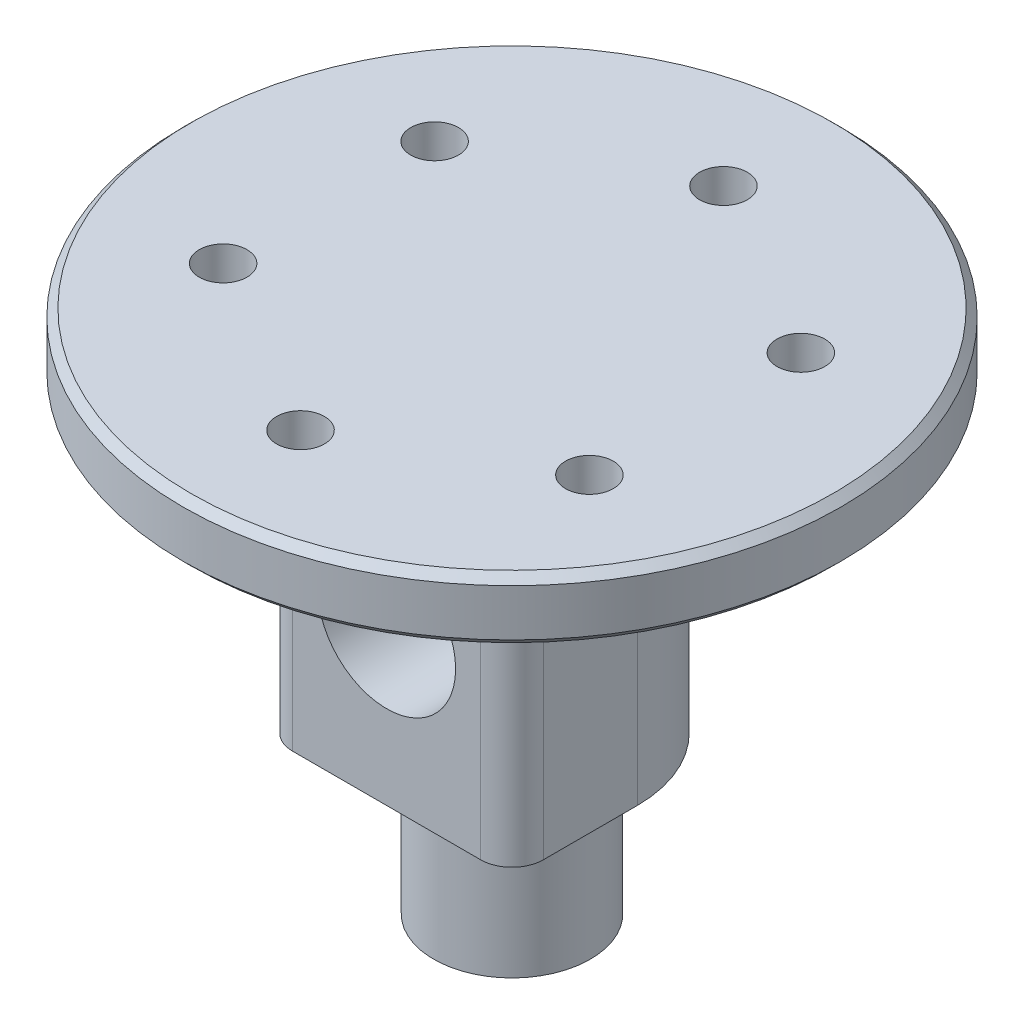
ISO-10303-21;
HEADER;
FILE_DESCRIPTION(('STEP AP214'),'2;1');
FILE_NAME('part.step','',(''),(''),'','','');
FILE_SCHEMA(('AUTOMOTIVE_DESIGN { 1 0 10303 214 1 1 1 1 }'));
ENDSEC;
DATA;
#1=APPLICATION_CONTEXT('core data for automotive mechanical design processes');
#2=APPLICATION_PROTOCOL_DEFINITION('international standard','automotive_design',2000,#1);
#3=PRODUCT_CONTEXT('',#1,'mechanical');
#4=PRODUCT('Part','Part','',(#3));
#5=PRODUCT_RELATED_PRODUCT_CATEGORY('part','',(#4));
#6=PRODUCT_DEFINITION_FORMATION('','',#4);
#7=PRODUCT_DEFINITION_CONTEXT('part definition',#1,'design');
#8=PRODUCT_DEFINITION('design','',#6,#7);
#9=PRODUCT_DEFINITION_SHAPE('','',#8);
#10=(LENGTH_UNIT() NAMED_UNIT(*) SI_UNIT(.MILLI.,.METRE.));
#11=(NAMED_UNIT(*) PLANE_ANGLE_UNIT() SI_UNIT($,.RADIAN.));
#12=(NAMED_UNIT(*) SI_UNIT($,.STERADIAN.) SOLID_ANGLE_UNIT());
#13=UNCERTAINTY_MEASURE_WITH_UNIT(LENGTH_MEASURE(1.E-05),#10,'distance_accuracy_value','');
#14=(GEOMETRIC_REPRESENTATION_CONTEXT(3) GLOBAL_UNCERTAINTY_ASSIGNED_CONTEXT((#13)) GLOBAL_UNIT_ASSIGNED_CONTEXT((#10,
#11,#12)) REPRESENTATION_CONTEXT('',''));
#15=CARTESIAN_POINT('',(0.,0.,0.));
#16=DIRECTION('',(0.,0.,1.));
#17=DIRECTION('',(1.,0.,0.));
#18=AXIS2_PLACEMENT_3D('',#15,#16,#17);
#19=CARTESIAN_POINT('',(0.,19.5,0.));
#20=DIRECTION('',(0.,1.,0.));
#21=DIRECTION('',(0.,0.,1.));
#22=AXIS2_PLACEMENT_3D('',#19,#20,#21);
#23=PLANE('',#22);
#24=CARTESIAN_POINT('',(0.,19.5,0.));
#25=DIRECTION('',(0.,1.,0.));
#26=DIRECTION('',(0.,0.,1.));
#27=AXIS2_PLACEMENT_3D('',#24,#25,#26);
#28=CIRCLE('',#27,20.5);
#29=CARTESIAN_POINT('',(0.,19.5,20.5));
#30=VERTEX_POINT('',#29);
#31=EDGE_CURVE('E11',#30,#30,#28,.F.);
#32=ORIENTED_EDGE('',*,*,#31,.T.);
#33=EDGE_LOOP('',(#32));
#34=FACE_BOUND('',#33,.T.);
#35=CARTESIAN_POINT('',(0.,19.5,-13.5));
#36=DIRECTION('',(0.,-1.,0.));
#37=DIRECTION('',(0.,0.,-1.));
#38=AXIS2_PLACEMENT_3D('',#35,#36,#37);
#39=CIRCLE('',#38,1.525);
#40=CARTESIAN_POINT('',(0.,19.5,-15.025));
#41=VERTEX_POINT('',#40);
#42=EDGE_CURVE('E162',#41,#41,#39,.T.);
#43=ORIENTED_EDGE('',*,*,#42,.F.);
#44=EDGE_LOOP('',(#43));
#45=FACE_BOUND('',#44,.T.);
#46=CARTESIAN_POINT('',(11.6913429510898,19.5,-6.75000000000014));
#47=DIRECTION('',(0.,-1.,0.));
#48=DIRECTION('',(0.,0.,-1.));
#49=AXIS2_PLACEMENT_3D('',#46,#47,#48);
#50=CIRCLE('',#49,1.525);
#51=CARTESIAN_POINT('',(11.6913429510898,19.5,-8.27500000000014));
#52=VERTEX_POINT('',#51);
#53=EDGE_CURVE('E156',#52,#52,#50,.T.);
#54=ORIENTED_EDGE('',*,*,#53,.F.);
#55=EDGE_LOOP('',(#54));
#56=FACE_BOUND('',#55,.T.);
#57=CARTESIAN_POINT('',(11.69134295109,19.5,6.74999999999989));
#58=DIRECTION('',(0.,-1.,0.));
#59=DIRECTION('',(0.,0.,-1.));
#60=AXIS2_PLACEMENT_3D('',#57,#58,#59);
#61=CIRCLE('',#60,1.525);
#62=CARTESIAN_POINT('',(11.69134295109,19.5,5.22499999999989));
#63=VERTEX_POINT('',#62);
#64=EDGE_CURVE('E171',#63,#63,#61,.T.);
#65=ORIENTED_EDGE('',*,*,#64,.F.);
#66=EDGE_LOOP('',(#65));
#67=FACE_BOUND('',#66,.T.);
#68=CARTESIAN_POINT('',(0.,19.5,13.5));
#69=DIRECTION('',(0.,-1.,0.));
#70=DIRECTION('',(0.,0.,-1.));
#71=AXIS2_PLACEMENT_3D('',#68,#69,#70);
#72=CIRCLE('',#71,1.525);
#73=CARTESIAN_POINT('',(0.,19.5,11.975));
#74=VERTEX_POINT('',#73);
#75=EDGE_CURVE('E194',#74,#74,#72,.T.);
#76=ORIENTED_EDGE('',*,*,#75,.F.);
#77=EDGE_LOOP('',(#76));
#78=FACE_BOUND('',#77,.T.);
#79=CARTESIAN_POINT('',(-11.6913429510899,19.5,6.75000000000005));
#80=DIRECTION('',(0.,-1.,0.));
#81=DIRECTION('',(0.,0.,-1.));
#82=AXIS2_PLACEMENT_3D('',#79,#80,#81);
#83=CIRCLE('',#82,1.525);
#84=CARTESIAN_POINT('',(-11.6913429510899,19.5,5.22500000000005));
#85=VERTEX_POINT('',#84);
#86=EDGE_CURVE('E186',#85,#85,#83,.T.);
#87=ORIENTED_EDGE('',*,*,#86,.F.);
#88=EDGE_LOOP('',(#87));
#89=FACE_BOUND('',#88,.T.);
#90=CARTESIAN_POINT('',(-11.6913429510899,19.5,-6.74999999999997));
#91=DIRECTION('',(0.,-1.,0.));
#92=DIRECTION('',(0.,0.,-1.));
#93=AXIS2_PLACEMENT_3D('',#90,#91,#92);
#94=CIRCLE('',#93,1.525);
#95=CARTESIAN_POINT('',(-11.6913429510899,19.5,-8.27499999999998));
#96=VERTEX_POINT('',#95);
#97=EDGE_CURVE('E178',#96,#96,#94,.T.);
#98=ORIENTED_EDGE('',*,*,#97,.F.);
#99=EDGE_LOOP('',(#98));
#100=FACE_BOUND('',#99,.T.);
#101=DIRECTION('',(-1.,0.,0.));
#102=VECTOR('',#101,1.);
#103=CARTESIAN_POINT('',(0.,19.5,8.));
#104=LINE('',#103,#102);
#105=CARTESIAN_POINT('',(6.,19.5,8.));
#106=VERTEX_POINT('',#105);
#107=CARTESIAN_POINT('',(-6.,19.5,8.));
#108=VERTEX_POINT('',#107);
#109=EDGE_CURVE('E133',#106,#108,#104,.T.);
#110=ORIENTED_EDGE('',*,*,#109,.F.);
#111=CARTESIAN_POINT('',(6.,19.5,6.));
#112=DIRECTION('',(0.,1.,0.));
#113=DIRECTION('',(0.,0.,1.));
#114=AXIS2_PLACEMENT_3D('',#111,#112,#113);
#115=CIRCLE('',#114,2.);
#116=CARTESIAN_POINT('',(8.,19.5,6.));
#117=VERTEX_POINT('',#116);
#118=EDGE_CURVE('E232',#106,#117,#115,.T.);
#119=ORIENTED_EDGE('',*,*,#118,.T.);
#120=DIRECTION('',(0.,0.,-1.));
#121=VECTOR('',#120,1.);
#122=CARTESIAN_POINT('',(8.,19.5,8.));
#123=LINE('',#122,#121);
#124=CARTESIAN_POINT('',(8.,19.5,0.));
#125=VERTEX_POINT('',#124);
#126=EDGE_CURVE('E153',#117,#125,#123,.T.);
#127=ORIENTED_EDGE('',*,*,#126,.T.);
#128=CARTESIAN_POINT('',(0.,19.5,0.));
#129=DIRECTION('',(0.,1.,0.));
#130=DIRECTION('',(0.,0.,1.));
#131=AXIS2_PLACEMENT_3D('',#128,#129,#130);
#132=CIRCLE('',#131,8.);
#133=CARTESIAN_POINT('',(-8.,19.5,0.));
#134=VERTEX_POINT('',#133);
#135=EDGE_CURVE('E205',#125,#134,#132,.T.);
#136=ORIENTED_EDGE('',*,*,#135,.T.);
#137=DIRECTION('',(0.,0.,-1.));
#138=VECTOR('',#137,1.);
#139=CARTESIAN_POINT('',(-8.,19.5,8.));
#140=LINE('',#139,#138);
#141=CARTESIAN_POINT('',(-8.,19.5,6.));
#142=VERTEX_POINT('',#141);
#143=EDGE_CURVE('E150',#142,#134,#140,.T.);
#144=ORIENTED_EDGE('',*,*,#143,.F.);
#145=CARTESIAN_POINT('',(-6.,19.5,6.));
#146=DIRECTION('',(0.,1.,0.));
#147=DIRECTION('',(0.,0.,1.));
#148=AXIS2_PLACEMENT_3D('',#145,#146,#147);
#149=CIRCLE('',#148,2.);
#150=EDGE_CURVE('E235',#142,#108,#149,.T.);
#151=ORIENTED_EDGE('',*,*,#150,.T.);
#152=EDGE_LOOP('',(#110,#119,#127,#136,#144,#151));
#153=FACE_BOUND('',#152,.T.);
#154=ADVANCED_FACE('F46',(#34,#45,#56,#67,#78,#89,#100,#153),#23,.F.);
#155=CARTESIAN_POINT('',(0.,19.5,0.));
#156=DIRECTION('',(0.,-1.,0.));
#157=DIRECTION('',(0.,0.,-1.));
#158=AXIS2_PLACEMENT_3D('',#155,#156,#157);
#159=CYLINDRICAL_SURFACE('',#158,8.);
#160=ORIENTED_EDGE('',*,*,#135,.F.);
#161=DIRECTION('',(0.,1.,0.));
#162=VECTOR('',#161,1.);
#163=CARTESIAN_POINT('',(8.,0.,0.));
#164=LINE('',#163,#162);
#165=CARTESIAN_POINT('',(8.,0.,0.));
#166=VERTEX_POINT('',#165);
#167=EDGE_CURVE('E120',#166,#125,#164,.T.);
#168=ORIENTED_EDGE('',*,*,#167,.F.);
#169=CARTESIAN_POINT('',(0.,0.,0.));
#170=DIRECTION('',(0.,1.,0.));
#171=DIRECTION('',(0.,0.,1.));
#172=AXIS2_PLACEMENT_3D('',#169,#170,#171);
#173=CIRCLE('',#172,8.);
#174=CARTESIAN_POINT('',(-8.,0.,0.));
#175=VERTEX_POINT('',#174);
#176=EDGE_CURVE('E161',#166,#175,#173,.T.);
#177=ORIENTED_EDGE('',*,*,#176,.T.);
#178=DIRECTION('',(0.,-1.,0.));
#179=VECTOR('',#178,1.);
#180=CARTESIAN_POINT('',(-8.,0.,0.));
#181=LINE('',#180,#179);
#182=EDGE_CURVE('E139',#134,#175,#181,.T.);
#183=ORIENTED_EDGE('',*,*,#182,.F.);
#184=EDGE_LOOP('',(#160,#168,#177,#183));
#185=FACE_BOUND('',#184,.T.);
#186=ADVANCED_FACE('F282',(#185),#159,.T.);
#187=CARTESIAN_POINT('',(0.,0.,0.));
#188=DIRECTION('',(0.,1.,0.));
#189=DIRECTION('',(0.,0.,1.));
#190=AXIS2_PLACEMENT_3D('',#187,#188,#189);
#191=PLANE('',#190);
#192=CARTESIAN_POINT('',(0.,0.,0.));
#193=DIRECTION('',(0.,-1.,0.));
#194=DIRECTION('',(0.,0.,-1.));
#195=AXIS2_PLACEMENT_3D('',#192,#193,#194);
#196=CIRCLE('',#195,5.);
#197=CARTESIAN_POINT('',(0.,0.,-5.));
#198=VERTEX_POINT('',#197);
#199=EDGE_CURVE('E128',#198,#198,#196,.T.);
#200=ORIENTED_EDGE('',*,*,#199,.F.);
#201=EDGE_LOOP('',(#200));
#202=FACE_BOUND('',#201,.T.);
#203=DIRECTION('',(0.,0.,-1.));
#204=VECTOR('',#203,1.);
#205=CARTESIAN_POINT('',(8.,0.,8.));
#206=LINE('',#205,#204);
#207=CARTESIAN_POINT('',(8.,0.,6.));
#208=VERTEX_POINT('',#207);
#209=EDGE_CURVE('E138',#208,#166,#206,.T.);
#210=ORIENTED_EDGE('',*,*,#209,.F.);
#211=CARTESIAN_POINT('',(6.,0.,6.));
#212=DIRECTION('',(0.,1.,0.));
#213=DIRECTION('',(0.,0.,1.));
#214=AXIS2_PLACEMENT_3D('',#211,#212,#213);
#215=CIRCLE('',#214,2.);
#216=CARTESIAN_POINT('',(6.,0.,8.));
#217=VERTEX_POINT('',#216);
#218=EDGE_CURVE('E227',#208,#217,#215,.F.);
#219=ORIENTED_EDGE('',*,*,#218,.T.);
#220=DIRECTION('',(1.,0.,0.));
#221=VECTOR('',#220,1.);
#222=CARTESIAN_POINT('',(-8.,0.,8.));
#223=LINE('',#222,#221);
#224=CARTESIAN_POINT('',(-6.,0.,8.));
#225=VERTEX_POINT('',#224);
#226=EDGE_CURVE('E134',#225,#217,#223,.T.);
#227=ORIENTED_EDGE('',*,*,#226,.F.);
#228=CARTESIAN_POINT('',(-6.,0.,6.));
#229=DIRECTION('',(0.,1.,0.));
#230=DIRECTION('',(0.,0.,1.));
#231=AXIS2_PLACEMENT_3D('',#228,#229,#230);
#232=CIRCLE('',#231,2.);
#233=CARTESIAN_POINT('',(-8.,0.,6.));
#234=VERTEX_POINT('',#233);
#235=EDGE_CURVE('E71',#225,#234,#232,.F.);
#236=ORIENTED_EDGE('',*,*,#235,.T.);
#237=DIRECTION('',(0.,0.,-1.));
#238=VECTOR('',#237,1.);
#239=CARTESIAN_POINT('',(-8.,0.,8.));
#240=LINE('',#239,#238);
#241=EDGE_CURVE('E148',#234,#175,#240,.T.);
#242=ORIENTED_EDGE('',*,*,#241,.T.);
#243=ORIENTED_EDGE('',*,*,#176,.F.);
#244=EDGE_LOOP('',(#210,#219,#227,#236,#242,#243));
#245=FACE_BOUND('',#244,.T.);
#246=ADVANCED_FACE('F310',(#202,#245),#191,.F.);
#247=CARTESIAN_POINT('',(0.,23.5,0.));
#248=DIRECTION('',(0.,-1.,0.));
#249=DIRECTION('',(0.,0.,-1.));
#250=AXIS2_PLACEMENT_3D('',#247,#248,#249);
#251=CYLINDRICAL_SURFACE('',#250,21.);
#252=CARTESIAN_POINT('',(0.,23.,0.));
#253=DIRECTION('',(0.,1.,0.));
#254=DIRECTION('',(0.,0.,1.));
#255=AXIS2_PLACEMENT_3D('',#252,#253,#254);
#256=CIRCLE('',#255,21.);
#257=CARTESIAN_POINT('',(0.,23.,21.));
#258=VERTEX_POINT('',#257);
#259=EDGE_CURVE('E56',#258,#258,#256,.F.);
#260=ORIENTED_EDGE('',*,*,#259,.T.);
#261=EDGE_LOOP('',(#260));
#262=FACE_BOUND('',#261,.T.);
#263=CARTESIAN_POINT('',(0.,20.,0.));
#264=DIRECTION('',(0.,1.,0.));
#265=DIRECTION('',(0.,0.,1.));
#266=AXIS2_PLACEMENT_3D('',#263,#264,#265);
#267=CIRCLE('',#266,21.);
#268=CARTESIAN_POINT('',(0.,20.,21.));
#269=VERTEX_POINT('',#268);
#270=EDGE_CURVE('E241',#269,#269,#267,.T.);
#271=ORIENTED_EDGE('',*,*,#270,.T.);
#272=EDGE_LOOP('',(#271));
#273=FACE_BOUND('',#272,.T.);
#274=ADVANCED_FACE('F248',(#262,#273),#251,.T.);
#275=CARTESIAN_POINT('',(0.,23.5,0.));
#276=DIRECTION('',(0.,1.,0.));
#277=DIRECTION('',(0.,0.,1.));
#278=AXIS2_PLACEMENT_3D('',#275,#276,#277);
#279=PLANE('',#278);
#280=CARTESIAN_POINT('',(0.,23.5,0.));
#281=DIRECTION('',(0.,1.,0.));
#282=DIRECTION('',(0.,0.,1.));
#283=AXIS2_PLACEMENT_3D('',#280,#281,#282);
#284=CIRCLE('',#283,20.5);
#285=CARTESIAN_POINT('',(0.,23.5,20.5));
#286=VERTEX_POINT('',#285);
#287=EDGE_CURVE('E237',#286,#286,#284,.T.);
#288=ORIENTED_EDGE('',*,*,#287,.T.);
#289=EDGE_LOOP('',(#288));
#290=FACE_BOUND('',#289,.T.);
#291=CARTESIAN_POINT('',(0.,23.5,-13.5));
#292=DIRECTION('',(0.,-1.,0.));
#293=DIRECTION('',(0.,0.,-1.));
#294=AXIS2_PLACEMENT_3D('',#291,#292,#293);
#295=CIRCLE('',#294,1.525);
#296=CARTESIAN_POINT('',(0.,23.5,-15.025));
#297=VERTEX_POINT('',#296);
#298=EDGE_CURVE('E157',#297,#297,#295,.T.);
#299=ORIENTED_EDGE('',*,*,#298,.T.);
#300=EDGE_LOOP('',(#299));
#301=FACE_BOUND('',#300,.T.);
#302=CARTESIAN_POINT('',(11.6913429510898,23.5,-6.75000000000014));
#303=DIRECTION('',(0.,-1.,0.));
#304=DIRECTION('',(0.,0.,-1.));
#305=AXIS2_PLACEMENT_3D('',#302,#303,#304);
#306=CIRCLE('',#305,1.525);
#307=CARTESIAN_POINT('',(11.6913429510898,23.5,-8.27500000000014));
#308=VERTEX_POINT('',#307);
#309=EDGE_CURVE('E167',#308,#308,#306,.T.);
#310=ORIENTED_EDGE('',*,*,#309,.T.);
#311=EDGE_LOOP('',(#310));
#312=FACE_BOUND('',#311,.T.);
#313=CARTESIAN_POINT('',(11.69134295109,23.5,6.74999999999989));
#314=DIRECTION('',(0.,-1.,0.));
#315=DIRECTION('',(0.,0.,-1.));
#316=AXIS2_PLACEMENT_3D('',#313,#314,#315);
#317=CIRCLE('',#316,1.525);
#318=CARTESIAN_POINT('',(11.69134295109,23.5,5.22499999999989));
#319=VERTEX_POINT('',#318);
#320=EDGE_CURVE('E198',#319,#319,#317,.T.);
#321=ORIENTED_EDGE('',*,*,#320,.T.);
#322=EDGE_LOOP('',(#321));
#323=FACE_BOUND('',#322,.T.);
#324=CARTESIAN_POINT('',(0.,23.5,13.5));
#325=DIRECTION('',(0.,-1.,0.));
#326=DIRECTION('',(0.,0.,-1.));
#327=AXIS2_PLACEMENT_3D('',#324,#325,#326);
#328=CIRCLE('',#327,1.525);
#329=CARTESIAN_POINT('',(0.,23.5,11.975));
#330=VERTEX_POINT('',#329);
#331=EDGE_CURVE('E190',#330,#330,#328,.T.);
#332=ORIENTED_EDGE('',*,*,#331,.T.);
#333=EDGE_LOOP('',(#332));
#334=FACE_BOUND('',#333,.T.);
#335=CARTESIAN_POINT('',(-11.6913429510899,23.5,6.75000000000005));
#336=DIRECTION('',(0.,-1.,0.));
#337=DIRECTION('',(0.,0.,-1.));
#338=AXIS2_PLACEMENT_3D('',#335,#336,#337);
#339=CIRCLE('',#338,1.525);
#340=CARTESIAN_POINT('',(-11.6913429510899,23.5,5.22500000000005));
#341=VERTEX_POINT('',#340);
#342=EDGE_CURVE('E182',#341,#341,#339,.T.);
#343=ORIENTED_EDGE('',*,*,#342,.T.);
#344=EDGE_LOOP('',(#343));
#345=FACE_BOUND('',#344,.T.);
#346=CARTESIAN_POINT('',(-11.6913429510899,23.5,-6.74999999999997));
#347=DIRECTION('',(0.,-1.,0.));
#348=DIRECTION('',(0.,0.,-1.));
#349=AXIS2_PLACEMENT_3D('',#346,#347,#348);
#350=CIRCLE('',#349,1.525);
#351=CARTESIAN_POINT('',(-11.6913429510899,23.5,-8.27499999999998));
#352=VERTEX_POINT('',#351);
#353=EDGE_CURVE('E166',#352,#352,#350,.T.);
#354=ORIENTED_EDGE('',*,*,#353,.T.);
#355=EDGE_LOOP('',(#354));
#356=FACE_BOUND('',#355,.T.);
#357=ADVANCED_FACE('F257',(#290,#301,#312,#323,#334,#345,#356),#279,.T.);
#358=CARTESIAN_POINT('',(-11.6913429510899,23.5,-6.74999999999997));
#359=DIRECTION('',(0.,-1.,0.));
#360=DIRECTION('',(0.,0.,-1.));
#361=AXIS2_PLACEMENT_3D('',#358,#359,#360);
#362=CYLINDRICAL_SURFACE('',#361,1.525);
#363=ORIENTED_EDGE('',*,*,#353,.F.);
#364=EDGE_LOOP('',(#363));
#365=FACE_BOUND('',#364,.T.);
#366=ORIENTED_EDGE('',*,*,#97,.T.);
#367=EDGE_LOOP('',(#366));
#368=FACE_BOUND('',#367,.T.);
#369=ADVANCED_FACE('F260',(#365,#368),#362,.F.);
#370=CARTESIAN_POINT('',(-11.6913429510899,23.5,6.75000000000005));
#371=DIRECTION('',(0.,-1.,0.));
#372=DIRECTION('',(0.,0.,-1.));
#373=AXIS2_PLACEMENT_3D('',#370,#371,#372);
#374=CYLINDRICAL_SURFACE('',#373,1.525);
#375=ORIENTED_EDGE('',*,*,#342,.F.);
#376=EDGE_LOOP('',(#375));
#377=FACE_BOUND('',#376,.T.);
#378=ORIENTED_EDGE('',*,*,#86,.T.);
#379=EDGE_LOOP('',(#378));
#380=FACE_BOUND('',#379,.T.);
#381=ADVANCED_FACE('F276',(#377,#380),#374,.F.);
#382=CARTESIAN_POINT('',(0.,23.5,13.5));
#383=DIRECTION('',(0.,-1.,0.));
#384=DIRECTION('',(0.,0.,-1.));
#385=AXIS2_PLACEMENT_3D('',#382,#383,#384);
#386=CYLINDRICAL_SURFACE('',#385,1.525);
#387=ORIENTED_EDGE('',*,*,#331,.F.);
#388=EDGE_LOOP('',(#387));
#389=FACE_BOUND('',#388,.T.);
#390=ORIENTED_EDGE('',*,*,#75,.T.);
#391=EDGE_LOOP('',(#390));
#392=FACE_BOUND('',#391,.T.);
#393=ADVANCED_FACE('F321',(#389,#392),#386,.F.);
#394=CARTESIAN_POINT('',(11.69134295109,23.5,6.74999999999989));
#395=DIRECTION('',(0.,-1.,0.));
#396=DIRECTION('',(0.,0.,-1.));
#397=AXIS2_PLACEMENT_3D('',#394,#395,#396);
#398=CYLINDRICAL_SURFACE('',#397,1.525);
#399=ORIENTED_EDGE('',*,*,#320,.F.);
#400=EDGE_LOOP('',(#399));
#401=FACE_BOUND('',#400,.T.);
#402=ORIENTED_EDGE('',*,*,#64,.T.);
#403=EDGE_LOOP('',(#402));
#404=FACE_BOUND('',#403,.T.);
#405=ADVANCED_FACE('F317',(#401,#404),#398,.F.);
#406=CARTESIAN_POINT('',(11.6913429510898,23.5,-6.75000000000014));
#407=DIRECTION('',(0.,-1.,0.));
#408=DIRECTION('',(0.,0.,-1.));
#409=AXIS2_PLACEMENT_3D('',#406,#407,#408);
#410=CYLINDRICAL_SURFACE('',#409,1.525);
#411=ORIENTED_EDGE('',*,*,#309,.F.);
#412=EDGE_LOOP('',(#411));
#413=FACE_BOUND('',#412,.T.);
#414=ORIENTED_EDGE('',*,*,#53,.T.);
#415=EDGE_LOOP('',(#414));
#416=FACE_BOUND('',#415,.T.);
#417=ADVANCED_FACE('F320',(#413,#416),#410,.F.);
#418=CARTESIAN_POINT('',(0.,23.5,-13.5));
#419=DIRECTION('',(0.,-1.,0.));
#420=DIRECTION('',(0.,0.,-1.));
#421=AXIS2_PLACEMENT_3D('',#418,#419,#420);
#422=CYLINDRICAL_SURFACE('',#421,1.525);
#423=ORIENTED_EDGE('',*,*,#298,.F.);
#424=EDGE_LOOP('',(#423));
#425=FACE_BOUND('',#424,.T.);
#426=ORIENTED_EDGE('',*,*,#42,.T.);
#427=EDGE_LOOP('',(#426));
#428=FACE_BOUND('',#427,.T.);
#429=ADVANCED_FACE('F331',(#425,#428),#422,.F.);
#430=CARTESIAN_POINT('',(0.,0.,8.));
#431=DIRECTION('',(0.,0.,-1.));
#432=DIRECTION('',(-1.,0.,0.));
#433=AXIS2_PLACEMENT_3D('',#430,#431,#432);
#434=PLANE('',#433);
#435=CARTESIAN_POINT('',(0.,9.75,8.));
#436=DIRECTION('',(0.,0.,1.));
#437=DIRECTION('',(1.,0.,0.));
#438=AXIS2_PLACEMENT_3D('',#435,#436,#437);
#439=CIRCLE('',#438,4.4);
#440=CARTESIAN_POINT('',(4.4,9.75,8.));
#441=VERTEX_POINT('',#440);
#442=EDGE_CURVE('E114',#441,#441,#439,.T.);
#443=ORIENTED_EDGE('',*,*,#442,.F.);
#444=EDGE_LOOP('',(#443));
#445=FACE_BOUND('',#444,.T.);
#446=ORIENTED_EDGE('',*,*,#226,.T.);
#447=DIRECTION('',(0.,1.,0.));
#448=VECTOR('',#447,1.);
#449=CARTESIAN_POINT('',(6.,0.,8.));
#450=LINE('',#449,#448);
#451=EDGE_CURVE('E218',#217,#106,#450,.T.);
#452=ORIENTED_EDGE('',*,*,#451,.T.);
#453=ORIENTED_EDGE('',*,*,#109,.T.);
#454=DIRECTION('',(0.,-1.,0.));
#455=VECTOR('',#454,1.);
#456=CARTESIAN_POINT('',(-6.,0.,8.));
#457=LINE('',#456,#455);
#458=EDGE_CURVE('E132',#108,#225,#457,.T.);
#459=ORIENTED_EDGE('',*,*,#458,.T.);
#460=EDGE_LOOP('',(#446,#452,#453,#459));
#461=FACE_BOUND('',#460,.T.);
#462=ADVANCED_FACE('F290',(#445,#461),#434,.F.);
#463=CARTESIAN_POINT('',(8.,0.,8.));
#464=DIRECTION('',(-1.,0.,0.));
#465=DIRECTION('',(0.,0.,1.));
#466=AXIS2_PLACEMENT_3D('',#463,#464,#465);
#467=PLANE('',#466);
#468=ORIENTED_EDGE('',*,*,#126,.F.);
#469=DIRECTION('',(0.,1.,0.));
#470=VECTOR('',#469,1.);
#471=CARTESIAN_POINT('',(8.,0.,6.));
#472=LINE('',#471,#470);
#473=EDGE_CURVE('E222',#117,#208,#472,.F.);
#474=ORIENTED_EDGE('',*,*,#473,.T.);
#475=ORIENTED_EDGE('',*,*,#209,.T.);
#476=ORIENTED_EDGE('',*,*,#167,.T.);
#477=EDGE_LOOP('',(#468,#474,#475,#476));
#478=FACE_BOUND('',#477,.T.);
#479=ADVANCED_FACE('F336',(#478),#467,.F.);
#480=CARTESIAN_POINT('',(-8.,0.,8.));
#481=DIRECTION('',(1.,0.,0.));
#482=DIRECTION('',(0.,0.,-1.));
#483=AXIS2_PLACEMENT_3D('',#480,#481,#482);
#484=PLANE('',#483);
#485=ORIENTED_EDGE('',*,*,#241,.F.);
#486=DIRECTION('',(0.,-1.,0.));
#487=VECTOR('',#486,1.);
#488=CARTESIAN_POINT('',(-8.,0.,6.));
#489=LINE('',#488,#487);
#490=EDGE_CURVE('E63',#234,#142,#489,.F.);
#491=ORIENTED_EDGE('',*,*,#490,.T.);
#492=ORIENTED_EDGE('',*,*,#143,.T.);
#493=ORIENTED_EDGE('',*,*,#182,.T.);
#494=EDGE_LOOP('',(#485,#491,#492,#493));
#495=FACE_BOUND('',#494,.T.);
#496=ADVANCED_FACE('F339',(#495),#484,.F.);
#497=CARTESIAN_POINT('',(0.,-10.,0.));
#498=DIRECTION('',(0.,1.,0.));
#499=DIRECTION('',(0.,0.,1.));
#500=AXIS2_PLACEMENT_3D('',#497,#498,#499);
#501=CYLINDRICAL_SURFACE('',#500,5.);
#502=CARTESIAN_POINT('',(0.,-10.,0.));
#503=DIRECTION('',(0.,-1.,0.));
#504=DIRECTION('',(0.,0.,-1.));
#505=AXIS2_PLACEMENT_3D('',#502,#503,#504);
#506=CIRCLE('',#505,5.);
#507=CARTESIAN_POINT('',(0.,-10.,-5.));
#508=VERTEX_POINT('',#507);
#509=EDGE_CURVE('E113',#508,#508,#506,.T.);
#510=ORIENTED_EDGE('',*,*,#509,.F.);
#511=EDGE_LOOP('',(#510));
#512=FACE_BOUND('',#511,.T.);
#513=ORIENTED_EDGE('',*,*,#199,.T.);
#514=EDGE_LOOP('',(#513));
#515=FACE_BOUND('',#514,.T.);
#516=ADVANCED_FACE('F343',(#512,#515),#501,.T.);
#517=CARTESIAN_POINT('',(0.,-10.,0.));
#518=DIRECTION('',(0.,-1.,0.));
#519=DIRECTION('',(0.,0.,-1.));
#520=AXIS2_PLACEMENT_3D('',#517,#518,#519);
#521=PLANE('',#520);
#522=CARTESIAN_POINT('',(0.,-10.,0.));
#523=DIRECTION('',(0.,-1.,0.));
#524=DIRECTION('',(0.,0.,-1.));
#525=AXIS2_PLACEMENT_3D('',#522,#523,#524);
#526=CIRCLE('',#525,2.025);
#527=CARTESIAN_POINT('',(0.,-10.,-2.025));
#528=VERTEX_POINT('',#527);
#529=EDGE_CURVE('E367',#528,#528,#526,.T.);
#530=ORIENTED_EDGE('',*,*,#529,.F.);
#531=EDGE_LOOP('',(#530));
#532=FACE_BOUND('',#531,.T.);
#533=ORIENTED_EDGE('',*,*,#509,.T.);
#534=EDGE_LOOP('',(#533));
#535=FACE_BOUND('',#534,.T.);
#536=ADVANCED_FACE('F106',(#532,#535),#521,.T.);
#537=CARTESIAN_POINT('',(0.,9.75,-3.));
#538=DIRECTION('',(0.,0.,1.));
#539=DIRECTION('',(1.,0.,0.));
#540=AXIS2_PLACEMENT_3D('',#537,#538,#539);
#541=CONICAL_SURFACE('',#540,4.4,1.02974425867665);
#542=CARTESIAN_POINT('',(0.,9.75,-5.64378672372127));
#543=VERTEX_POINT('',#542);
#544=VERTEX_LOOP('',#543);
#545=FACE_BOUND('',#544,.T.);
#546=CARTESIAN_POINT('',(0.,9.75,-3.));
#547=DIRECTION('',(0.,0.,1.));
#548=DIRECTION('',(1.,0.,0.));
#549=AXIS2_PLACEMENT_3D('',#546,#547,#548);
#550=CIRCLE('',#549,4.4);
#551=CARTESIAN_POINT('',(4.4,9.75,-3.));
#552=VERTEX_POINT('',#551);
#553=EDGE_CURVE('E110',#552,#552,#550,.T.);
#554=ORIENTED_EDGE('',*,*,#553,.T.);
#555=EDGE_LOOP('',(#554));
#556=FACE_BOUND('',#555,.T.);
#557=ADVANCED_FACE('F102',(#545,#556),#541,.F.);
#558=CARTESIAN_POINT('',(0.,9.75,8.));
#559=DIRECTION('',(0.,0.,1.));
#560=DIRECTION('',(1.,0.,0.));
#561=AXIS2_PLACEMENT_3D('',#558,#559,#560);
#562=CYLINDRICAL_SURFACE('',#561,4.4);
#563=CARTESIAN_POINT('',(0.,5.35,-2.025));
#564=CARTESIAN_POINT('',(-0.107446502482318,5.35000470367119,-2.02499435875587));
#565=CARTESIAN_POINT('',(-0.21505020679601,5.35397924488477,-2.01639794680418));
#566=CARTESIAN_POINT('',(-0.427139209064999,5.36948425272483,-1.98236347836655));
#567=CARTESIAN_POINT('',(-0.531616858574839,5.38103188256607,-1.95688716488263));
#568=CARTESIAN_POINT('',(-0.734052256137956,5.41046182616636,-1.89026527078593));
#569=CARTESIAN_POINT('',(-0.832032368354469,5.42832091083143,-1.8491771079299));
#570=CARTESIAN_POINT('',(-1.01959185682635,5.46868613762628,-1.75276510770651));
#571=CARTESIAN_POINT('',(-1.1091727838834,5.49119141942869,-1.6974439053774));
#572=CARTESIAN_POINT('',(-1.28279752460503,5.54013097750565,-1.57073747030788));
#573=CARTESIAN_POINT('',(-1.366287494625,5.5667111602421,-1.49865034737225));
#574=CARTESIAN_POINT('',(-1.52048759244352,5.6202551207435,-1.34195339292791));
#575=CARTESIAN_POINT('',(-1.59118954460985,5.64721913210007,-1.25733561274465));
#576=CARTESIAN_POINT('',(-1.72224258152705,5.70040778674446,-1.07155144425285));
#577=CARTESIAN_POINT('',(-1.78166112215155,5.72647886760826,-0.969678395580655));
#578=CARTESIAN_POINT('',(-1.88227550235223,5.77254816767871,-0.756029701913998));
#579=CARTESIAN_POINT('',(-1.92348268952739,5.79255016612291,-0.644260275679275));
#580=CARTESIAN_POINT('',(-1.98409767697456,5.82260248733497,-0.420333244284957));
#581=CARTESIAN_POINT('',(-2.00457876732512,5.83313918630585,-0.308534339484934));
#582=CARTESIAN_POINT('',(-2.02648694349223,5.84442454298002,-0.0826296505018774));
#583=CARTESIAN_POINT('',(-2.02792822995268,5.84518049554479,0.0314743508232345));
#584=CARTESIAN_POINT('',(-2.01251219960935,5.83722097178517,0.246840822895474));
#585=CARTESIAN_POINT('',(-1.99742411455568,5.82942116242359,0.348271257850947));
#586=CARTESIAN_POINT('',(-1.95239443063388,5.80680534864898,0.546956904237828));
#587=CARTESIAN_POINT('',(-1.92244916247071,5.79198761105147,0.644211077803078));
#588=CARTESIAN_POINT('',(-1.84796527072676,5.75666185489156,0.834464238232515));
#589=CARTESIAN_POINT('',(-1.80310795013238,5.7360312188162,0.927314640073452));
#590=CARTESIAN_POINT('',(-1.7003056525838,5.69141694645488,1.10457933766792));
#591=CARTESIAN_POINT('',(-1.64235500946938,5.66743186024149,1.18898995820881));
#592=CARTESIAN_POINT('',(-1.50787428387919,5.61574969886438,1.35633318927644));
#593=CARTESIAN_POINT('',(-1.4300305887715,5.58792764960967,1.43817493847564));
#594=CARTESIAN_POINT('',(-1.26151906856254,5.53379326436695,1.58805381102762));
#595=CARTESIAN_POINT('',(-1.17084681600601,5.50748145402561,1.65608614858868));
#596=CARTESIAN_POINT('',(-0.975310338249801,5.45823359521961,1.77852058659469));
#597=CARTESIAN_POINT('',(-0.870070275664605,5.43544153868725,1.83238485804869));
#598=CARTESIAN_POINT('',(-0.650704058134571,5.39696101593143,1.92124611171337));
#599=CARTESIAN_POINT('',(-0.536583971233666,5.38126774794902,1.95625585056138));
#600=CARTESIAN_POINT('',(-0.311726684559742,5.35971160779815,2.0039140724192));
#601=CARTESIAN_POINT('',(-0.201360042845578,5.35320946976538,2.0180204331743));
#602=CARTESIAN_POINT('',(0.020349394085051,5.34865236596074,2.0279325020217));
#603=CARTESIAN_POINT('',(0.131691809276131,5.35059424579272,2.02374504405598));
#604=CARTESIAN_POINT('',(0.344735373192353,5.36230937461563,1.99814065554292));
#605=CARTESIAN_POINT('',(0.446600764387045,5.371579275068,1.97783078183235));
#606=CARTESIAN_POINT('',(0.645319544261309,5.39642725025269,1.92219614636415));
#607=CARTESIAN_POINT('',(0.742172338086909,5.41200607174899,1.88686960711398));
#608=CARTESIAN_POINT('',(0.931527616040319,5.44862256718215,1.80111612167222));
#609=CARTESIAN_POINT('',(1.02380351665554,5.46981390686364,1.75025669944987));
#610=CARTESIAN_POINT('',(1.19884062098788,5.51550153943132,1.63535300145594));
#611=CARTESIAN_POINT('',(1.28159761973899,5.53999928261167,1.57130293332597));
#612=CARTESIAN_POINT('',(1.44274121072501,5.59232323643665,1.42545489547323));
#613=CARTESIAN_POINT('',(1.52014474593965,5.6202547401997,1.34260608850315));
#614=CARTESIAN_POINT('',(1.66031278589952,5.67458286553001,1.1648208581975));
#615=CARTESIAN_POINT('',(1.72307084952117,5.70097880793578,1.0698791446331));
#616=CARTESIAN_POINT('',(1.8338169808113,5.74988752365524,0.866886150232638));
#617=CARTESIAN_POINT('',(1.88131114168742,5.77226171871477,0.75852931099021));
#618=CARTESIAN_POINT('',(1.95690478197582,5.80889376610348,0.533987069102887));
#619=CARTESIAN_POINT('',(1.98502500223839,5.82316029525136,0.417810185009595));
#620=CARTESIAN_POINT('',(2.01881496661177,5.84043309046757,0.192006867279483));
#621=CARTESIAN_POINT('',(2.0262545042107,5.84432573598633,0.0827131927288242));
#622=CARTESIAN_POINT('',(2.02340063600598,5.84284550335715,-0.135564398431534));
#623=CARTESIAN_POINT('',(2.01311182330898,5.83747502512281,-0.244548387948053));
#624=CARTESIAN_POINT('',(1.97667536982734,5.81895414000877,-0.451261913435858));
#625=CARTESIAN_POINT('',(1.95167155762184,5.80636640525398,-0.549249005777004));
#626=CARTESIAN_POINT('',(1.88777687191057,5.77538658202719,-0.73960155218991));
#627=CARTESIAN_POINT('',(1.84888190232818,5.75699278171042,-0.831965338708482));
#628=CARTESIAN_POINT('',(1.75539866203633,5.71498311445568,-1.01511474331157));
#629=CARTESIAN_POINT('',(1.69994700324533,5.6911034939779,-1.10539769288976));
#630=CARTESIAN_POINT('',(1.57599714540356,5.64138832222971,-1.27592335715533));
#631=CARTESIAN_POINT('',(1.50749302926806,5.61555188708726,-1.35616149077318));
#632=CARTESIAN_POINT('',(1.35158454130429,5.56184448458218,-1.51233597513098));
#633=CARTESIAN_POINT('',(1.26299412568581,5.53401783041859,-1.58710966967852));
#634=CARTESIAN_POINT('',(1.07359208353384,5.48185788437158,-1.72089046341334));
#635=CARTESIAN_POINT('',(0.972774764137473,5.45752623137133,-1.77989017692919));
#636=CARTESIAN_POINT('',(0.76216819461465,5.41519299461905,-1.8796826958081));
#637=CARTESIAN_POINT('',(0.652449259482177,5.39714681439359,-1.92060434900312));
#638=CARTESIAN_POINT('',(0.42680036579758,5.36928457092283,-1.98294796119893));
#639=CARTESIAN_POINT('',(0.310890149368153,5.35944383603811,-2.00442839166233));
#640=CARTESIAN_POINT('',(0.161771584520253,5.35285484639105,-2.01878956310743));
#641=CARTESIAN_POINT('',(0.129474813539635,5.35178632689955,-2.0211160574479));
#642=CARTESIAN_POINT('',(0.0647901281857299,5.35035818824465,-2.02422214008317));
#643=CARTESIAN_POINT('',(0.0324022122215667,5.34999858153268,-2.02500170120744));
#644=CARTESIAN_POINT('',(0.,5.35,-2.025));
#645=B_SPLINE_CURVE_WITH_KNOTS('',3,(#563,#564,#565,#566,#567,#568,#569,#570,#571,#572,#573,
#574,#575,#576,#577,#578,#579,#580,#581,#582,#583,#584,#585,#586,#587,#588,#589,#590,#591,#592,
#593,#594,#595,#596,#597,#598,#599,#600,#601,#602,#603,#604,#605,#606,#607,#608,#609,#610,#611,
#612,#613,#614,#615,#616,#617,#618,#619,#620,#621,#622,#623,#624,#625,#626,#627,#628,#629,#630,
#631,#632,#633,#634,#635,#636,#637,#638,#639,#640,#641,#642,#643,#644),.UNSPECIFIED.,.T.,.F.,(4,
2,2,2,2,2,2,2,2,2,2,2,2,2,2,2,2,2,2,2,2,2,2,2,2,2,2,2,2,2,2,2,2,2,2,2,2,2,2,2,4),(0.,
0.322206861478314,0.645146489453998,0.96690971947113,1.28861342256349,1.62755389773285,
1.966710304158,2.32723045470523,2.68752564525386,3.02802597429348,3.36827233027821,
3.67536696558587,3.98253748217875,4.29674714691885,4.6110930478167,4.95852772294988,
5.30608260028946,5.66537347002387,6.02442094365233,6.35700630038938,6.68946742529308,
7.00089026551785,7.31234997850793,7.63342423918862,7.95463979378302,8.30339572801669,
8.65230475832497,9.01157411676329,9.37045825779268,9.69751600490443,10.0244890297931,
10.3288898572264,10.6333805173435,10.9578827730106,11.2825324871584,11.6385164205569,
11.9946667415087,12.3482360210713,12.7007383366569,12.7979032652063,12.8950699003565),.UNSPECIFIED.);
#646=CARTESIAN_POINT('',(0.,5.35,-2.025));
#647=VERTEX_POINT('',#646);
#648=EDGE_CURVE('E124',#647,#647,#645,.T.);
#649=ORIENTED_EDGE('',*,*,#648,.F.);
#650=EDGE_LOOP('',(#649));
#651=FACE_BOUND('',#650,.T.);
#652=ORIENTED_EDGE('',*,*,#553,.F.);
#653=EDGE_LOOP('',(#652));
#654=FACE_BOUND('',#653,.T.);
#655=ORIENTED_EDGE('',*,*,#442,.T.);
#656=EDGE_LOOP('',(#655));
#657=FACE_BOUND('',#656,.T.);
#658=ADVANCED_FACE('F105',(#651,#654,#657),#562,.F.);
#659=CARTESIAN_POINT('',(0.,23.501,0.));
#660=DIRECTION('',(0.,-1.,0.));
#661=DIRECTION('',(0.,0.,-1.));
#662=AXIS2_PLACEMENT_3D('',#659,#660,#661);
#663=CYLINDRICAL_SURFACE('',#662,2.025);
#664=ORIENTED_EDGE('',*,*,#648,.T.);
#665=EDGE_LOOP('',(#664));
#666=FACE_BOUND('',#665,.T.);
#667=ORIENTED_EDGE('',*,*,#529,.T.);
#668=EDGE_LOOP('',(#667));
#669=FACE_BOUND('',#668,.T.);
#670=ADVANCED_FACE('F299',(#666,#669),#663,.F.);
#671=CARTESIAN_POINT('',(6.,0.,6.));
#672=DIRECTION('',(0.,1.,0.));
#673=DIRECTION('',(0.,0.,1.));
#674=AXIS2_PLACEMENT_3D('',#671,#672,#673);
#675=CYLINDRICAL_SURFACE('',#674,2.);
#676=ORIENTED_EDGE('',*,*,#218,.F.);
#677=ORIENTED_EDGE('',*,*,#473,.F.);
#678=ORIENTED_EDGE('',*,*,#118,.F.);
#679=ORIENTED_EDGE('',*,*,#451,.F.);
#680=EDGE_LOOP('',(#676,#677,#678,#679));
#681=FACE_BOUND('',#680,.T.);
#682=ADVANCED_FACE('F294',(#681),#675,.T.);
#683=CARTESIAN_POINT('',(-6.,0.,6.));
#684=DIRECTION('',(0.,-1.,0.));
#685=DIRECTION('',(0.,0.,-1.));
#686=AXIS2_PLACEMENT_3D('',#683,#684,#685);
#687=CYLINDRICAL_SURFACE('',#686,2.);
#688=ORIENTED_EDGE('',*,*,#150,.F.);
#689=ORIENTED_EDGE('',*,*,#490,.F.);
#690=ORIENTED_EDGE('',*,*,#235,.F.);
#691=ORIENTED_EDGE('',*,*,#458,.F.);
#692=EDGE_LOOP('',(#688,#689,#690,#691));
#693=FACE_BOUND('',#692,.T.);
#694=ADVANCED_FACE('F254',(#693),#687,.T.);
#695=CARTESIAN_POINT('',(0.,23.5,0.));
#696=DIRECTION('',(0.,-1.,0.));
#697=DIRECTION('',(0.,0.,-1.));
#698=AXIS2_PLACEMENT_3D('',#695,#696,#697);
#699=CONICAL_SURFACE('',#698,20.5,0.785398163397448);
#700=ORIENTED_EDGE('',*,*,#259,.F.);
#701=EDGE_LOOP('',(#700));
#702=FACE_BOUND('',#701,.T.);
#703=ORIENTED_EDGE('',*,*,#287,.F.);
#704=EDGE_LOOP('',(#703));
#705=FACE_BOUND('',#704,.T.);
#706=ADVANCED_FACE('F251',(#702,#705),#699,.T.);
#707=CARTESIAN_POINT('',(0.,20.,0.));
#708=DIRECTION('',(0.,1.,0.));
#709=DIRECTION('',(0.,0.,1.));
#710=AXIS2_PLACEMENT_3D('',#707,#708,#709);
#711=CONICAL_SURFACE('',#710,21.,0.785398163397455);
#712=ORIENTED_EDGE('',*,*,#31,.F.);
#713=EDGE_LOOP('',(#712));
#714=FACE_BOUND('',#713,.T.);
#715=ORIENTED_EDGE('',*,*,#270,.F.);
#716=EDGE_LOOP('',(#715));
#717=FACE_BOUND('',#716,.T.);
#718=ADVANCED_FACE('F49',(#714,#717),#711,.T.);
#719=CLOSED_SHELL('',(#154,#186,#246,#274,#357,#369,#381,#393,#405,#417,#429,#462,#479,#496,
#516,#536,#557,#658,#670,#682,#694,#706,#718));
#720=MANIFOLD_SOLID_BREP('B2',#719);
#721=ADVANCED_BREP_SHAPE_REPRESENTATION('',(#18,#720),#14);
#722=SHAPE_DEFINITION_REPRESENTATION(#9,#721);
ENDSEC;
END-ISO-10303-21;
